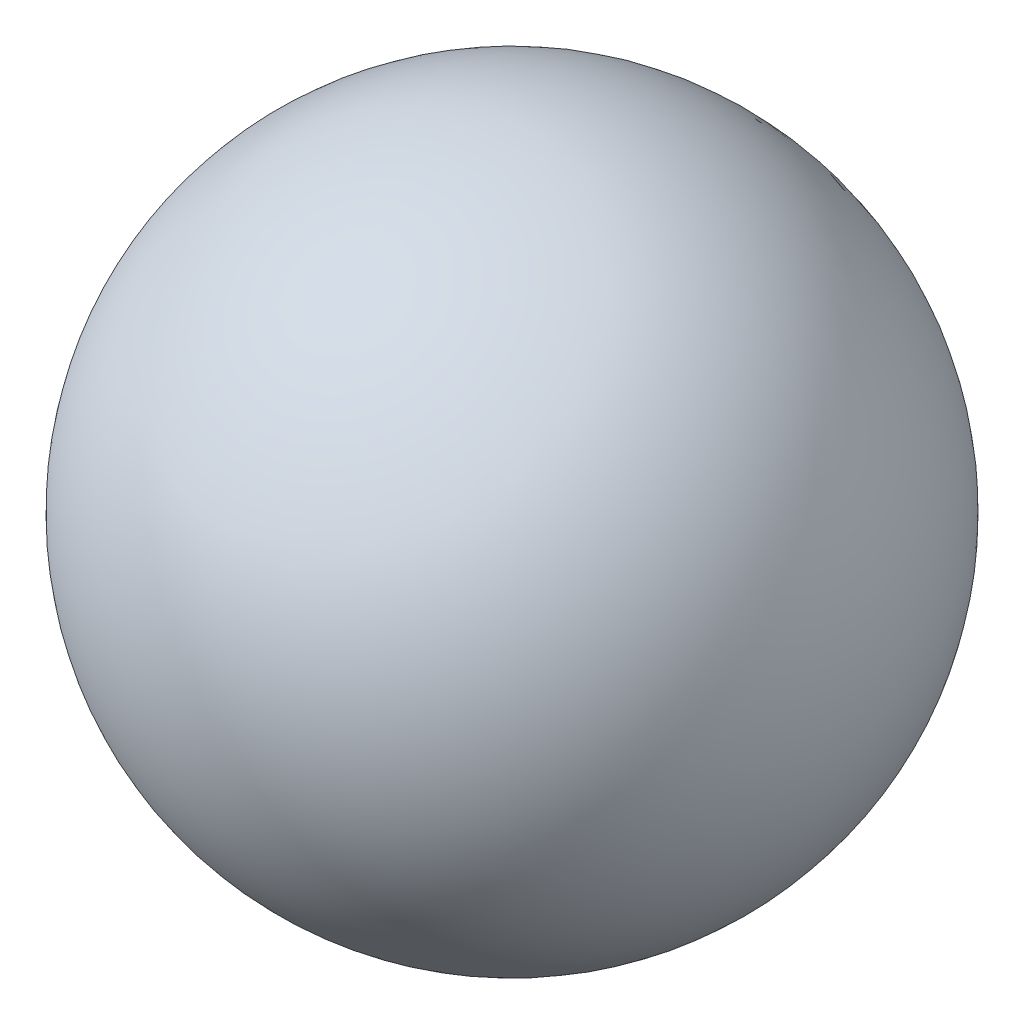
ISO-10303-21;
HEADER;
FILE_DESCRIPTION(('STEP AP214'),'2;1');
FILE_NAME('part.step','',(''),(''),'','','');
FILE_SCHEMA(('AUTOMOTIVE_DESIGN { 1 0 10303 214 1 1 1 1 }'));
ENDSEC;
DATA;
#1=APPLICATION_CONTEXT('core data for automotive mechanical design processes');
#2=APPLICATION_PROTOCOL_DEFINITION('international standard','automotive_design',2000,#1);
#3=PRODUCT_CONTEXT('',#1,'mechanical');
#4=PRODUCT('Part','Part','',(#3));
#5=PRODUCT_RELATED_PRODUCT_CATEGORY('part','',(#4));
#6=PRODUCT_DEFINITION_FORMATION('','',#4);
#7=PRODUCT_DEFINITION_CONTEXT('part definition',#1,'design');
#8=PRODUCT_DEFINITION('design','',#6,#7);
#9=PRODUCT_DEFINITION_SHAPE('','',#8);
#10=(LENGTH_UNIT() NAMED_UNIT(*) SI_UNIT(.MILLI.,.METRE.));
#11=(NAMED_UNIT(*) PLANE_ANGLE_UNIT() SI_UNIT($,.RADIAN.));
#12=(NAMED_UNIT(*) SI_UNIT($,.STERADIAN.) SOLID_ANGLE_UNIT());
#13=UNCERTAINTY_MEASURE_WITH_UNIT(LENGTH_MEASURE(1.E-05),#10,'distance_accuracy_value','');
#14=(GEOMETRIC_REPRESENTATION_CONTEXT(3) GLOBAL_UNCERTAINTY_ASSIGNED_CONTEXT((#13)) GLOBAL_UNIT_ASSIGNED_CONTEXT((#10,
#11,#12)) REPRESENTATION_CONTEXT('',''));
#15=CARTESIAN_POINT('',(0.,0.,0.));
#16=DIRECTION('',(0.,0.,1.));
#17=DIRECTION('',(1.,0.,0.));
#18=AXIS2_PLACEMENT_3D('',#15,#16,#17);
#19=CARTESIAN_POINT('',(57.535,-44.6012192731661,-42.3893469116588));
#20=DIRECTION('',(0.,-0.724851812050188,-0.68890481967218));
#21=DIRECTION('',(0.173648177666933,0.67843880750064,-0.713839684291973));
#22=AXIS2_PLACEMENT_3D('',#19,#20,#21);
#23=SPHERICAL_SURFACE('',#22,6.75);
#24=CARTESIAN_POINT('',(57.535,-49.4939690045049,-47.039454444446));
#25=VERTEX_POINT('',#24);
#26=VERTEX_LOOP('',#25);
#27=FACE_BOUND('',#26,.T.);
#28=CARTESIAN_POINT('',(57.535,-39.7084695418273,-37.7392393788716));
#29=VERTEX_POINT('',#28);
#30=VERTEX_LOOP('',#29);
#31=FACE_BOUND('',#30,.T.);
#32=ADVANCED_FACE('F16',(#27,#31),#23,.T.);
#33=CLOSED_SHELL('',(#32));
#34=MANIFOLD_SOLID_BREP('B1',#33);
#35=ADVANCED_BREP_SHAPE_REPRESENTATION('',(#18,#34),#14);
#36=SHAPE_DEFINITION_REPRESENTATION(#9,#35);
ENDSEC;
END-ISO-10303-21;
